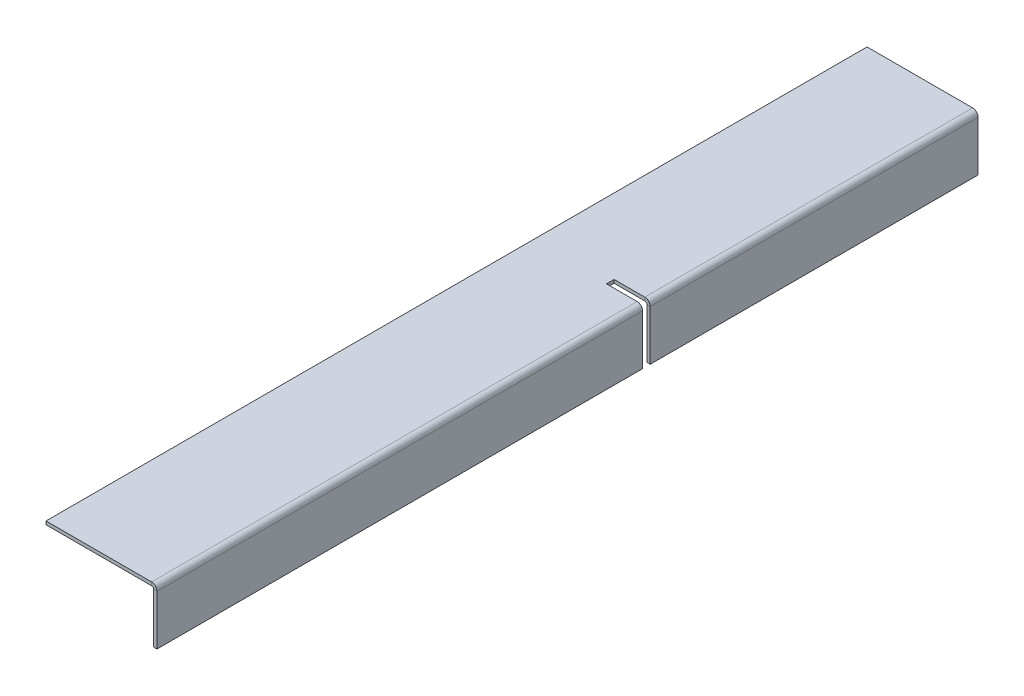
ISO-10303-21;
HEADER;
FILE_DESCRIPTION(('STEP AP214'),'2;1');
FILE_NAME('part.step','',(''),(''),'','','');
FILE_SCHEMA(('AUTOMOTIVE_DESIGN { 1 0 10303 214 1 1 1 1 }'));
ENDSEC;
DATA;
#1=APPLICATION_CONTEXT('core data for automotive mechanical design processes');
#2=APPLICATION_PROTOCOL_DEFINITION('international standard','automotive_design',2000,#1);
#3=PRODUCT_CONTEXT('',#1,'mechanical');
#4=PRODUCT('Part','Part','',(#3));
#5=PRODUCT_RELATED_PRODUCT_CATEGORY('part','',(#4));
#6=PRODUCT_DEFINITION_FORMATION('','',#4);
#7=PRODUCT_DEFINITION_CONTEXT('part definition',#1,'design');
#8=PRODUCT_DEFINITION('design','',#6,#7);
#9=PRODUCT_DEFINITION_SHAPE('','',#8);
#10=(LENGTH_UNIT() NAMED_UNIT(*) SI_UNIT(.MILLI.,.METRE.));
#11=(NAMED_UNIT(*) PLANE_ANGLE_UNIT() SI_UNIT($,.RADIAN.));
#12=(NAMED_UNIT(*) SI_UNIT($,.STERADIAN.) SOLID_ANGLE_UNIT());
#13=UNCERTAINTY_MEASURE_WITH_UNIT(LENGTH_MEASURE(1.E-05),#10,'distance_accuracy_value','');
#14=(GEOMETRIC_REPRESENTATION_CONTEXT(3) GLOBAL_UNCERTAINTY_ASSIGNED_CONTEXT((#13)) GLOBAL_UNIT_ASSIGNED_CONTEXT((#10,
#11,#12)) REPRESENTATION_CONTEXT('',''));
#15=CARTESIAN_POINT('',(0.,0.,0.));
#16=DIRECTION('',(0.,0.,1.));
#17=DIRECTION('',(1.,0.,0.));
#18=AXIS2_PLACEMENT_3D('',#15,#16,#17);
#19=CARTESIAN_POINT('',(-13.,20.2395491076024,118.183385949314));
#20=DIRECTION('',(0.,0.,-1.));
#21=DIRECTION('',(-1.,0.,0.));
#22=AXIS2_PLACEMENT_3D('',#19,#20,#21);
#23=PLANE('',#22);
#24=DIRECTION('',(0.,1.,0.));
#25=VECTOR('',#24,1.);
#26=CARTESIAN_POINT('',(0.,20.2395491076024,118.183385949314));
#27=LINE('',#26,#25);
#28=CARTESIAN_POINT('',(0.,0.,118.183385949314));
#29=VERTEX_POINT('',#28);
#30=CARTESIAN_POINT('',(0.,18.0634,118.183385949314));
#31=VERTEX_POINT('',#30);
#32=EDGE_CURVE('E305',#29,#31,#27,.T.);
#33=ORIENTED_EDGE('',*,*,#32,.T.);
#34=DIRECTION('',(-1.,0.,0.));
#35=VECTOR('',#34,1.);
#36=CARTESIAN_POINT('',(0.,18.0634,118.183385949314));
#37=LINE('',#36,#35);
#38=CARTESIAN_POINT('',(-1.19999999999998,18.0634,118.183385949314));
#39=VERTEX_POINT('',#38);
#40=EDGE_CURVE('E11',#31,#39,#37,.T.);
#41=ORIENTED_EDGE('',*,*,#40,.T.);
#42=DIRECTION('',(0.,-1.,0.));
#43=VECTOR('',#42,1.);
#44=CARTESIAN_POINT('',(-1.19999999999998,0.,118.183385949314));
#45=LINE('',#44,#43);
#46=CARTESIAN_POINT('',(-1.19999999999998,0.,118.183385949314));
#47=VERTEX_POINT('',#46);
#48=EDGE_CURVE('E312',#39,#47,#45,.T.);
#49=ORIENTED_EDGE('',*,*,#48,.T.);
#50=DIRECTION('',(1.,0.,0.));
#51=VECTOR('',#50,1.);
#52=CARTESIAN_POINT('',(0.,0.,118.183385949314));
#53=LINE('',#52,#51);
#54=EDGE_CURVE('E285',#47,#29,#53,.T.);
#55=ORIENTED_EDGE('',*,*,#54,.T.);
#56=EDGE_LOOP('',(#33,#41,#49,#55));
#57=FACE_BOUND('',#56,.T.);
#58=ADVANCED_FACE('F44',(#57),#23,.F.);
#59=DIRECTION('',(1.,0.,0.));
#60=VECTOR('',#59,1.);
#61=CARTESIAN_POINT('',(0.,18.8,118.183385949314));
#62=LINE('',#61,#60);
#63=CARTESIAN_POINT('',(-13.,18.8,118.183385949314));
#64=VERTEX_POINT('',#63);
#65=CARTESIAN_POINT('',(-1.93659999999996,18.8,118.183385949314));
#66=VERTEX_POINT('',#65);
#67=EDGE_CURVE('E274',#64,#66,#62,.T.);
#68=ORIENTED_EDGE('',*,*,#67,.T.);
#69=DIRECTION('',(0.,1.,0.));
#70=VECTOR('',#69,1.);
#71=CARTESIAN_POINT('',(-1.93659999999996,18.8,118.183385949314));
#72=LINE('',#71,#70);
#73=CARTESIAN_POINT('',(-1.93659999999996,20.,118.183385949314));
#74=VERTEX_POINT('',#73);
#75=EDGE_CURVE('E53',#66,#74,#72,.T.);
#76=ORIENTED_EDGE('',*,*,#75,.T.);
#77=DIRECTION('',(1.,0.,0.));
#78=VECTOR('',#77,1.);
#79=CARTESIAN_POINT('',(0.,20.,118.183385949314));
#80=LINE('',#79,#78);
#81=CARTESIAN_POINT('',(-13.,20.,118.183385949314));
#82=VERTEX_POINT('',#81);
#83=EDGE_CURVE('E270',#82,#74,#80,.T.);
#84=ORIENTED_EDGE('',*,*,#83,.F.);
#85=DIRECTION('',(0.,1.,0.));
#86=VECTOR('',#85,1.);
#87=CARTESIAN_POINT('',(-13.,20.2395491076024,118.183385949314));
#88=LINE('',#87,#86);
#89=EDGE_CURVE('E286',#64,#82,#88,.T.);
#90=ORIENTED_EDGE('',*,*,#89,.F.);
#91=EDGE_LOOP('',(#68,#76,#84,#90));
#92=FACE_BOUND('',#91,.T.);
#93=ADVANCED_FACE('F267',(#92),#23,.F.);
#94=CARTESIAN_POINT('',(-13.,20.2395491076025,120.933385949314));
#95=DIRECTION('',(0.,0.,1.));
#96=DIRECTION('',(1.,0.,0.));
#97=AXIS2_PLACEMENT_3D('',#94,#95,#96);
#98=PLANE('',#97);
#99=DIRECTION('',(0.,1.,0.));
#100=VECTOR('',#99,1.);
#101=CARTESIAN_POINT('',(-1.19999999999998,0.,120.933385949314));
#102=LINE('',#101,#100);
#103=CARTESIAN_POINT('',(-1.19999999999998,0.,120.933385949314));
#104=VERTEX_POINT('',#103);
#105=CARTESIAN_POINT('',(-1.19999999999998,18.0634,120.933385949314));
#106=VERTEX_POINT('',#105);
#107=EDGE_CURVE('E331',#104,#106,#102,.T.);
#108=ORIENTED_EDGE('',*,*,#107,.T.);
#109=DIRECTION('',(1.,0.,0.));
#110=VECTOR('',#109,1.);
#111=CARTESIAN_POINT('',(-1.19999999999998,18.0634,120.933385949314));
#112=LINE('',#111,#110);
#113=CARTESIAN_POINT('',(0.,18.0634,120.933385949314));
#114=VERTEX_POINT('',#113);
#115=EDGE_CURVE('E254',#106,#114,#112,.T.);
#116=ORIENTED_EDGE('',*,*,#115,.T.);
#117=DIRECTION('',(0.,-1.,0.));
#118=VECTOR('',#117,1.);
#119=CARTESIAN_POINT('',(0.,20.2395491076025,120.933385949314));
#120=LINE('',#119,#118);
#121=CARTESIAN_POINT('',(0.,0.,120.933385949314));
#122=VERTEX_POINT('',#121);
#123=EDGE_CURVE('E308',#114,#122,#120,.T.);
#124=ORIENTED_EDGE('',*,*,#123,.T.);
#125=DIRECTION('',(-1.,0.,0.));
#126=VECTOR('',#125,1.);
#127=CARTESIAN_POINT('',(0.,0.,120.933385949314));
#128=LINE('',#127,#126);
#129=EDGE_CURVE('E135',#122,#104,#128,.T.);
#130=ORIENTED_EDGE('',*,*,#129,.T.);
#131=EDGE_LOOP('',(#108,#116,#124,#130));
#132=FACE_BOUND('',#131,.T.);
#133=ADVANCED_FACE('F394',(#132),#98,.F.);
#134=DIRECTION('',(-1.,0.,0.));
#135=VECTOR('',#134,1.);
#136=CARTESIAN_POINT('',(0.,20.,120.933385949314));
#137=LINE('',#136,#135);
#138=CARTESIAN_POINT('',(-1.93659999999996,20.,120.933385949314));
#139=VERTEX_POINT('',#138);
#140=CARTESIAN_POINT('',(-13.,20.,120.933385949314));
#141=VERTEX_POINT('',#140);
#142=EDGE_CURVE('E322',#139,#141,#137,.T.);
#143=ORIENTED_EDGE('',*,*,#142,.F.);
#144=DIRECTION('',(0.,-1.,0.));
#145=VECTOR('',#144,1.);
#146=CARTESIAN_POINT('',(-1.93659999999996,20.,120.933385949314));
#147=LINE('',#146,#145);
#148=CARTESIAN_POINT('',(-1.93659999999996,18.8,120.933385949314));
#149=VERTEX_POINT('',#148);
#150=EDGE_CURVE('E250',#139,#149,#147,.T.);
#151=ORIENTED_EDGE('',*,*,#150,.T.);
#152=DIRECTION('',(-1.,0.,0.));
#153=VECTOR('',#152,1.);
#154=CARTESIAN_POINT('',(0.,18.8,120.933385949314));
#155=LINE('',#154,#153);
#156=CARTESIAN_POINT('',(-13.,18.8,120.933385949314));
#157=VERTEX_POINT('',#156);
#158=EDGE_CURVE('E339',#149,#157,#155,.T.);
#159=ORIENTED_EDGE('',*,*,#158,.T.);
#160=DIRECTION('',(0.,-1.,0.));
#161=VECTOR('',#160,1.);
#162=CARTESIAN_POINT('',(-13.,20.2395491076025,120.933385949314));
#163=LINE('',#162,#161);
#164=EDGE_CURVE('E307',#141,#157,#163,.T.);
#165=ORIENTED_EDGE('',*,*,#164,.F.);
#166=EDGE_LOOP('',(#143,#151,#159,#165));
#167=FACE_BOUND('',#166,.T.);
#168=ADVANCED_FACE('F414',(#167),#98,.F.);
#169=CARTESIAN_POINT('',(-1.93659999999996,18.0634,296.));
#170=DIRECTION('',(0.,0.,-1.));
#171=DIRECTION('',(-1.,0.,0.));
#172=AXIS2_PLACEMENT_3D('',#169,#170,#171);
#173=CYLINDRICAL_SURFACE('',#172,0.7366);
#174=CARTESIAN_POINT('',(-1.93659999999996,18.0634,120.933385949314));
#175=DIRECTION('',(0.,0.,1.));
#176=DIRECTION('',(1.,0.,0.));
#177=AXIS2_PLACEMENT_3D('',#174,#175,#176);
#178=CIRCLE('',#177,0.7366);
#179=EDGE_CURVE('E335',#106,#149,#178,.T.);
#180=ORIENTED_EDGE('',*,*,#179,.F.);
#181=DIRECTION('',(0.,0.,-1.));
#182=VECTOR('',#181,1.);
#183=CARTESIAN_POINT('',(-1.19999999999998,18.0634,296.));
#184=LINE('',#183,#182);
#185=CARTESIAN_POINT('',(-1.19999999999998,18.0634,296.));
#186=VERTEX_POINT('',#185);
#187=EDGE_CURVE('E211',#186,#106,#184,.T.);
#188=ORIENTED_EDGE('',*,*,#187,.F.);
#189=CARTESIAN_POINT('',(-1.93659999999996,18.0634,296.));
#190=DIRECTION('',(0.,0.,1.));
#191=DIRECTION('',(1.,0.,0.));
#192=AXIS2_PLACEMENT_3D('',#189,#190,#191);
#193=CIRCLE('',#192,0.7366);
#194=CARTESIAN_POINT('',(-1.93659999999996,18.8,296.));
#195=VERTEX_POINT('',#194);
#196=EDGE_CURVE('E162',#186,#195,#193,.T.);
#197=ORIENTED_EDGE('',*,*,#196,.T.);
#198=DIRECTION('',(0.,0.,-1.));
#199=VECTOR('',#198,1.);
#200=CARTESIAN_POINT('',(-1.93659999999996,18.8,296.));
#201=LINE('',#200,#199);
#202=EDGE_CURVE('E216',#195,#149,#201,.T.);
#203=ORIENTED_EDGE('',*,*,#202,.T.);
#204=EDGE_LOOP('',(#180,#188,#197,#203));
#205=FACE_BOUND('',#204,.T.);
#206=ADVANCED_FACE('F361',(#205),#173,.F.);
#207=CARTESIAN_POINT('',(-1.19999999999998,0.,296.));
#208=DIRECTION('',(-1.,0.,0.));
#209=DIRECTION('',(0.,0.,1.));
#210=AXIS2_PLACEMENT_3D('',#207,#208,#209);
#211=PLANE('',#210);
#212=ORIENTED_EDGE('',*,*,#107,.F.);
#213=DIRECTION('',(0.,0.,-1.));
#214=VECTOR('',#213,1.);
#215=CARTESIAN_POINT('',(-1.19999999999998,0.,296.));
#216=LINE('',#215,#214);
#217=CARTESIAN_POINT('',(-1.19999999999998,0.,296.));
#218=VERTEX_POINT('',#217);
#219=EDGE_CURVE('E207',#218,#104,#216,.T.);
#220=ORIENTED_EDGE('',*,*,#219,.F.);
#221=DIRECTION('',(0.,1.,0.));
#222=VECTOR('',#221,1.);
#223=CARTESIAN_POINT('',(-1.19999999999998,0.,296.));
#224=LINE('',#223,#222);
#225=EDGE_CURVE('E156',#218,#186,#224,.T.);
#226=ORIENTED_EDGE('',*,*,#225,.T.);
#227=ORIENTED_EDGE('',*,*,#187,.T.);
#228=EDGE_LOOP('',(#212,#220,#226,#227));
#229=FACE_BOUND('',#228,.T.);
#230=ADVANCED_FACE('F366',(#229),#211,.T.);
#231=CARTESIAN_POINT('',(0.,0.,296.));
#232=DIRECTION('',(0.,-1.,0.));
#233=DIRECTION('',(0.,0.,-1.));
#234=AXIS2_PLACEMENT_3D('',#231,#232,#233);
#235=PLANE('',#234);
#236=ORIENTED_EDGE('',*,*,#129,.F.);
#237=DIRECTION('',(0.,0.,-1.));
#238=VECTOR('',#237,1.);
#239=CARTESIAN_POINT('',(0.,0.,296.));
#240=LINE('',#239,#238);
#241=CARTESIAN_POINT('',(0.,0.,296.));
#242=VERTEX_POINT('',#241);
#243=EDGE_CURVE('E127',#242,#122,#240,.T.);
#244=ORIENTED_EDGE('',*,*,#243,.F.);
#245=DIRECTION('',(-1.,0.,0.));
#246=VECTOR('',#245,1.);
#247=CARTESIAN_POINT('',(0.,0.,296.));
#248=LINE('',#247,#246);
#249=EDGE_CURVE('E132',#242,#218,#248,.T.);
#250=ORIENTED_EDGE('',*,*,#249,.T.);
#251=ORIENTED_EDGE('',*,*,#219,.T.);
#252=EDGE_LOOP('',(#236,#244,#250,#251));
#253=FACE_BOUND('',#252,.T.);
#254=ADVANCED_FACE('F129',(#253),#235,.T.);
#255=CARTESIAN_POINT('',(0.,0.,296.));
#256=DIRECTION('',(-1.,0.,0.));
#257=DIRECTION('',(0.,0.,1.));
#258=AXIS2_PLACEMENT_3D('',#255,#256,#257);
#259=PLANE('',#258);
#260=ORIENTED_EDGE('',*,*,#243,.T.);
#261=ORIENTED_EDGE('',*,*,#123,.F.);
#262=DIRECTION('',(0.,0.,-1.));
#263=VECTOR('',#262,1.);
#264=CARTESIAN_POINT('',(0.,18.0634,296.));
#265=LINE('',#264,#263);
#266=CARTESIAN_POINT('',(0.,18.0634,296.));
#267=VERTEX_POINT('',#266);
#268=EDGE_CURVE('E147',#267,#114,#265,.T.);
#269=ORIENTED_EDGE('',*,*,#268,.F.);
#270=DIRECTION('',(0.,1.,0.));
#271=VECTOR('',#270,1.);
#272=CARTESIAN_POINT('',(0.,0.,296.));
#273=LINE('',#272,#271);
#274=EDGE_CURVE('E144',#242,#267,#273,.T.);
#275=ORIENTED_EDGE('',*,*,#274,.F.);
#276=EDGE_LOOP('',(#260,#261,#269,#275));
#277=FACE_BOUND('',#276,.T.);
#278=ADVANCED_FACE('F145',(#277),#259,.F.);
#279=CARTESIAN_POINT('',(-1.93659999999996,18.0634,296.));
#280=DIRECTION('',(0.,0.,-1.));
#281=DIRECTION('',(-1.,0.,0.));
#282=AXIS2_PLACEMENT_3D('',#279,#280,#281);
#283=CYLINDRICAL_SURFACE('',#282,1.9366);
#284=ORIENTED_EDGE('',*,*,#268,.T.);
#285=CARTESIAN_POINT('',(-1.93659999999996,18.0634,120.933385949314));
#286=DIRECTION('',(0.,0.,1.));
#287=DIRECTION('',(1.,0.,0.));
#288=AXIS2_PLACEMENT_3D('',#285,#286,#287);
#289=CIRCLE('',#288,1.9366);
#290=EDGE_CURVE('E242',#114,#139,#289,.T.);
#291=ORIENTED_EDGE('',*,*,#290,.T.);
#292=DIRECTION('',(0.,0.,-1.));
#293=VECTOR('',#292,1.);
#294=CARTESIAN_POINT('',(-1.93659999999996,20.,296.));
#295=LINE('',#294,#293);
#296=CARTESIAN_POINT('',(-1.93659999999996,20.,296.));
#297=VERTEX_POINT('',#296);
#298=EDGE_CURVE('E200',#297,#139,#295,.T.);
#299=ORIENTED_EDGE('',*,*,#298,.F.);
#300=CARTESIAN_POINT('',(-1.93659999999996,18.0634,296.));
#301=DIRECTION('',(0.,0.,-1.));
#302=DIRECTION('',(-1.,0.,0.));
#303=AXIS2_PLACEMENT_3D('',#300,#301,#302);
#304=CIRCLE('',#303,1.9366);
#305=EDGE_CURVE('E151',#267,#297,#304,.F.);
#306=ORIENTED_EDGE('',*,*,#305,.F.);
#307=EDGE_LOOP('',(#284,#291,#299,#306));
#308=FACE_BOUND('',#307,.T.);
#309=ADVANCED_FACE('F402',(#308),#283,.T.);
#310=CARTESIAN_POINT('',(0.,18.0634,296.));
#311=DIRECTION('',(0.,0.,1.));
#312=DIRECTION('',(1.,0.,0.));
#313=AXIS2_PLACEMENT_3D('',#310,#311,#312);
#314=PLANE('',#313);
#315=DIRECTION('',(-1.,0.,0.));
#316=VECTOR('',#315,1.);
#317=CARTESIAN_POINT('',(0.,18.0634,296.));
#318=LINE('',#317,#316);
#319=EDGE_CURVE('E235',#267,#186,#318,.T.);
#320=ORIENTED_EDGE('',*,*,#319,.F.);
#321=ORIENTED_EDGE('',*,*,#305,.T.);
#322=DIRECTION('',(0.,1.,0.));
#323=VECTOR('',#322,1.);
#324=CARTESIAN_POINT('',(-1.93659999999996,18.8,296.));
#325=LINE('',#324,#323);
#326=EDGE_CURVE('E67',#195,#297,#325,.T.);
#327=ORIENTED_EDGE('',*,*,#326,.F.);
#328=ORIENTED_EDGE('',*,*,#196,.F.);
#329=EDGE_LOOP('',(#320,#321,#327,#328));
#330=FACE_BOUND('',#329,.T.);
#331=ADVANCED_FACE('F46',(#330),#314,.T.);
#332=CARTESIAN_POINT('',(-1.93659999999996,18.8,296.));
#333=DIRECTION('',(0.,0.,1.));
#334=DIRECTION('',(1.,0.,0.));
#335=AXIS2_PLACEMENT_3D('',#332,#333,#334);
#336=PLANE('',#335);
#337=ORIENTED_EDGE('',*,*,#274,.T.);
#338=ORIENTED_EDGE('',*,*,#319,.T.);
#339=ORIENTED_EDGE('',*,*,#225,.F.);
#340=ORIENTED_EDGE('',*,*,#249,.F.);
#341=EDGE_LOOP('',(#337,#338,#339,#340));
#342=FACE_BOUND('',#341,.T.);
#343=ADVANCED_FACE('F154',(#342),#336,.T.);
#344=CARTESIAN_POINT('',(-1.93659999999996,20.0000000000001,0.));
#345=DIRECTION('',(0.,0.,-1.));
#346=DIRECTION('',(-1.,0.,0.));
#347=AXIS2_PLACEMENT_3D('',#344,#345,#346);
#348=PLANE('',#347);
#349=DIRECTION('',(0.,-1.,0.));
#350=VECTOR('',#349,1.);
#351=CARTESIAN_POINT('',(-1.93659999999996,20.0000000000001,0.));
#352=LINE('',#351,#350);
#353=CARTESIAN_POINT('',(-1.93659999999996,20.0000000000001,0.));
#354=VERTEX_POINT('',#353);
#355=CARTESIAN_POINT('',(-1.93659999999996,18.8000000000001,0.));
#356=VERTEX_POINT('',#355);
#357=EDGE_CURVE('E230',#354,#356,#352,.T.);
#358=ORIENTED_EDGE('',*,*,#357,.F.);
#359=CARTESIAN_POINT('',(-1.93659999999996,18.0634,0.));
#360=DIRECTION('',(0.,0.,-1.));
#361=DIRECTION('',(-1.,0.,0.));
#362=AXIS2_PLACEMENT_3D('',#359,#360,#361);
#363=CIRCLE('',#362,1.9366);
#364=CARTESIAN_POINT('',(0.,18.0634,0.));
#365=VERTEX_POINT('',#364);
#366=EDGE_CURVE('E196',#365,#354,#363,.F.);
#367=ORIENTED_EDGE('',*,*,#366,.F.);
#368=DIRECTION('',(1.,0.,0.));
#369=VECTOR('',#368,1.);
#370=CARTESIAN_POINT('',(-1.19999999999998,18.0634,0.));
#371=LINE('',#370,#369);
#372=CARTESIAN_POINT('',(-1.19999999999998,18.0634,0.));
#373=VERTEX_POINT('',#372);
#374=EDGE_CURVE('E226',#373,#365,#371,.T.);
#375=ORIENTED_EDGE('',*,*,#374,.F.);
#376=CARTESIAN_POINT('',(-1.93659999999996,18.0634,0.));
#377=DIRECTION('',(0.,0.,1.));
#378=DIRECTION('',(1.,0.,0.));
#379=AXIS2_PLACEMENT_3D('',#376,#377,#378);
#380=CIRCLE('',#379,0.7366);
#381=EDGE_CURVE('E180',#373,#356,#380,.T.);
#382=ORIENTED_EDGE('',*,*,#381,.T.);
#383=EDGE_LOOP('',(#358,#367,#375,#382));
#384=FACE_BOUND('',#383,.T.);
#385=ADVANCED_FACE('F431',(#384),#348,.T.);
#386=CARTESIAN_POINT('',(-1.19999999999998,18.0634,0.));
#387=DIRECTION('',(0.,0.,-1.));
#388=DIRECTION('',(-1.,0.,0.));
#389=AXIS2_PLACEMENT_3D('',#386,#387,#388);
#390=PLANE('',#389);
#391=DIRECTION('',(-1.,0.,0.));
#392=VECTOR('',#391,1.);
#393=CARTESIAN_POINT('',(0.,20.0000000000001,0.));
#394=LINE('',#393,#392);
#395=CARTESIAN_POINT('',(-40.,20.0000000000001,0.));
#396=VERTEX_POINT('',#395);
#397=EDGE_CURVE('E168',#354,#396,#394,.T.);
#398=ORIENTED_EDGE('',*,*,#397,.F.);
#399=ORIENTED_EDGE('',*,*,#357,.T.);
#400=DIRECTION('',(1.,0.,0.));
#401=VECTOR('',#400,1.);
#402=CARTESIAN_POINT('',(0.,18.8000000000001,0.));
#403=LINE('',#402,#401);
#404=CARTESIAN_POINT('',(-40.,18.8000000000001,0.));
#405=VERTEX_POINT('',#404);
#406=EDGE_CURVE('E176',#356,#405,#403,.F.);
#407=ORIENTED_EDGE('',*,*,#406,.T.);
#408=DIRECTION('',(0.,1.,0.));
#409=VECTOR('',#408,1.);
#410=CARTESIAN_POINT('',(-40.,18.8000000000001,0.));
#411=LINE('',#410,#409);
#412=EDGE_CURVE('E171',#405,#396,#411,.T.);
#413=ORIENTED_EDGE('',*,*,#412,.T.);
#414=EDGE_LOOP('',(#398,#399,#407,#413));
#415=FACE_BOUND('',#414,.T.);
#416=ADVANCED_FACE('F429',(#415),#390,.T.);
#417=CARTESIAN_POINT('',(0.,20.,296.));
#418=DIRECTION('',(0.,-1.,0.));
#419=DIRECTION('',(0.,0.,-1.));
#420=AXIS2_PLACEMENT_3D('',#417,#418,#419);
#421=PLANE('',#420);
#422=ORIENTED_EDGE('',*,*,#298,.T.);
#423=ORIENTED_EDGE('',*,*,#142,.T.);
#424=DIRECTION('',(0.,0.,1.));
#425=VECTOR('',#424,1.);
#426=CARTESIAN_POINT('',(-13.,20.,296.));
#427=LINE('',#426,#425);
#428=EDGE_CURVE('E172',#82,#141,#427,.T.);
#429=ORIENTED_EDGE('',*,*,#428,.F.);
#430=ORIENTED_EDGE('',*,*,#83,.T.);
#431=EDGE_CURVE('E102',#74,#354,#295,.T.);
#432=ORIENTED_EDGE('',*,*,#431,.T.);
#433=ORIENTED_EDGE('',*,*,#397,.T.);
#434=DIRECTION('',(0.,0.,-1.));
#435=VECTOR('',#434,1.);
#436=CARTESIAN_POINT('',(-40.,20.,296.));
#437=LINE('',#436,#435);
#438=CARTESIAN_POINT('',(-40.,20.,296.));
#439=VERTEX_POINT('',#438);
#440=EDGE_CURVE('E223',#439,#396,#437,.T.);
#441=ORIENTED_EDGE('',*,*,#440,.F.);
#442=DIRECTION('',(-1.,0.,0.));
#443=VECTOR('',#442,1.);
#444=CARTESIAN_POINT('',(0.,20.,296.));
#445=LINE('',#444,#443);
#446=EDGE_CURVE('E108',#297,#439,#445,.T.);
#447=ORIENTED_EDGE('',*,*,#446,.F.);
#448=EDGE_LOOP('',(#422,#423,#429,#430,#432,#433,#441,#447));
#449=FACE_BOUND('',#448,.T.);
#450=ADVANCED_FACE('F282',(#449),#421,.F.);
#451=CARTESIAN_POINT('',(-40.,18.8,296.));
#452=DIRECTION('',(-1.,0.,0.));
#453=DIRECTION('',(0.,0.,1.));
#454=AXIS2_PLACEMENT_3D('',#451,#452,#453);
#455=PLANE('',#454);
#456=ORIENTED_EDGE('',*,*,#412,.F.);
#457=DIRECTION('',(0.,0.,-1.));
#458=VECTOR('',#457,1.);
#459=CARTESIAN_POINT('',(-40.,18.8,296.));
#460=LINE('',#459,#458);
#461=CARTESIAN_POINT('',(-40.,18.8,296.));
#462=VERTEX_POINT('',#461);
#463=EDGE_CURVE('E220',#462,#405,#460,.T.);
#464=ORIENTED_EDGE('',*,*,#463,.F.);
#465=DIRECTION('',(0.,1.,0.));
#466=VECTOR('',#465,1.);
#467=CARTESIAN_POINT('',(-40.,18.8,296.));
#468=LINE('',#467,#466);
#469=EDGE_CURVE('E347',#462,#439,#468,.T.);
#470=ORIENTED_EDGE('',*,*,#469,.T.);
#471=ORIENTED_EDGE('',*,*,#440,.T.);
#472=EDGE_LOOP('',(#456,#464,#470,#471));
#473=FACE_BOUND('',#472,.T.);
#474=ADVANCED_FACE('F405',(#473),#455,.T.);
#475=CARTESIAN_POINT('',(0.,18.8,296.));
#476=DIRECTION('',(0.,-1.,0.));
#477=DIRECTION('',(0.,0.,-1.));
#478=AXIS2_PLACEMENT_3D('',#475,#476,#477);
#479=PLANE('',#478);
#480=ORIENTED_EDGE('',*,*,#158,.F.);
#481=ORIENTED_EDGE('',*,*,#202,.F.);
#482=DIRECTION('',(1.,0.,0.));
#483=VECTOR('',#482,1.);
#484=CARTESIAN_POINT('',(0.,18.8,296.));
#485=LINE('',#484,#483);
#486=EDGE_CURVE('E351',#195,#462,#485,.F.);
#487=ORIENTED_EDGE('',*,*,#486,.T.);
#488=ORIENTED_EDGE('',*,*,#463,.T.);
#489=ORIENTED_EDGE('',*,*,#406,.F.);
#490=EDGE_CURVE('E215',#66,#356,#201,.T.);
#491=ORIENTED_EDGE('',*,*,#490,.F.);
#492=ORIENTED_EDGE('',*,*,#67,.F.);
#493=DIRECTION('',(0.,0.,1.));
#494=VECTOR('',#493,1.);
#495=CARTESIAN_POINT('',(-13.,18.8,296.));
#496=LINE('',#495,#494);
#497=EDGE_CURVE('E246',#64,#157,#496,.T.);
#498=ORIENTED_EDGE('',*,*,#497,.T.);
#499=EDGE_LOOP('',(#480,#481,#487,#488,#489,#491,#492,#498));
#500=FACE_BOUND('',#499,.T.);
#501=ADVANCED_FACE('F409',(#500),#479,.T.);
#502=CARTESIAN_POINT('',(-1.93659999999996,18.0634,118.183385949314));
#503=DIRECTION('',(0.,0.,-1.));
#504=DIRECTION('',(-1.,0.,0.));
#505=AXIS2_PLACEMENT_3D('',#502,#503,#504);
#506=CIRCLE('',#505,0.7366);
#507=EDGE_CURVE('E316',#66,#39,#506,.T.);
#508=ORIENTED_EDGE('',*,*,#507,.F.);
#509=ORIENTED_EDGE('',*,*,#490,.T.);
#510=ORIENTED_EDGE('',*,*,#381,.F.);
#511=EDGE_CURVE('E210',#39,#373,#184,.T.);
#512=ORIENTED_EDGE('',*,*,#511,.F.);
#513=EDGE_LOOP('',(#508,#509,#510,#512));
#514=FACE_BOUND('',#513,.T.);
#515=ADVANCED_FACE('F426',(#514),#173,.F.);
#516=ORIENTED_EDGE('',*,*,#48,.F.);
#517=ORIENTED_EDGE('',*,*,#511,.T.);
#518=DIRECTION('',(0.,1.,0.));
#519=VECTOR('',#518,1.);
#520=CARTESIAN_POINT('',(-1.19999999999998,0.,0.));
#521=LINE('',#520,#519);
#522=CARTESIAN_POINT('',(-1.19999999999998,0.,0.));
#523=VERTEX_POINT('',#522);
#524=EDGE_CURVE('E184',#523,#373,#521,.T.);
#525=ORIENTED_EDGE('',*,*,#524,.F.);
#526=EDGE_CURVE('E139',#47,#523,#216,.T.);
#527=ORIENTED_EDGE('',*,*,#526,.F.);
#528=EDGE_LOOP('',(#516,#517,#525,#527));
#529=FACE_BOUND('',#528,.T.);
#530=ADVANCED_FACE('F448',(#529),#211,.T.);
#531=ORIENTED_EDGE('',*,*,#54,.F.);
#532=ORIENTED_EDGE('',*,*,#526,.T.);
#533=DIRECTION('',(-1.,0.,0.));
#534=VECTOR('',#533,1.);
#535=CARTESIAN_POINT('',(0.,0.,0.));
#536=LINE('',#535,#534);
#537=CARTESIAN_POINT('',(0.,0.,0.));
#538=VERTEX_POINT('',#537);
#539=EDGE_CURVE('E188',#538,#523,#536,.T.);
#540=ORIENTED_EDGE('',*,*,#539,.F.);
#541=EDGE_CURVE('E140',#29,#538,#240,.T.);
#542=ORIENTED_EDGE('',*,*,#541,.F.);
#543=EDGE_LOOP('',(#531,#532,#540,#542));
#544=FACE_BOUND('',#543,.T.);
#545=ADVANCED_FACE('F444',(#544),#235,.T.);
#546=EDGE_CURVE('E204',#31,#365,#265,.T.);
#547=ORIENTED_EDGE('',*,*,#546,.F.);
#548=ORIENTED_EDGE('',*,*,#32,.F.);
#549=ORIENTED_EDGE('',*,*,#541,.T.);
#550=DIRECTION('',(0.,1.,0.));
#551=VECTOR('',#550,1.);
#552=CARTESIAN_POINT('',(0.,0.,0.));
#553=LINE('',#552,#551);
#554=EDGE_CURVE('E192',#538,#365,#553,.T.);
#555=ORIENTED_EDGE('',*,*,#554,.T.);
#556=EDGE_LOOP('',(#547,#548,#549,#555));
#557=FACE_BOUND('',#556,.T.);
#558=ADVANCED_FACE('F439',(#557),#259,.F.);
#559=ORIENTED_EDGE('',*,*,#431,.F.);
#560=CARTESIAN_POINT('',(-1.93659999999996,18.0634,118.183385949314));
#561=DIRECTION('',(0.,0.,-1.));
#562=DIRECTION('',(-1.,0.,0.));
#563=AXIS2_PLACEMENT_3D('',#560,#561,#562);
#564=CIRCLE('',#563,1.9366);
#565=EDGE_CURVE('E238',#74,#31,#564,.T.);
#566=ORIENTED_EDGE('',*,*,#565,.T.);
#567=ORIENTED_EDGE('',*,*,#546,.T.);
#568=ORIENTED_EDGE('',*,*,#366,.T.);
#569=EDGE_LOOP('',(#559,#566,#567,#568));
#570=FACE_BOUND('',#569,.T.);
#571=ADVANCED_FACE('F288',(#570),#283,.T.);
#572=CARTESIAN_POINT('',(-1.93659999999996,18.0634,296.));
#573=DIRECTION('',(0.,0.,1.));
#574=DIRECTION('',(1.,0.,0.));
#575=AXIS2_PLACEMENT_3D('',#572,#573,#574);
#576=PLANE('',#575);
#577=ORIENTED_EDGE('',*,*,#446,.T.);
#578=ORIENTED_EDGE('',*,*,#469,.F.);
#579=ORIENTED_EDGE('',*,*,#486,.F.);
#580=ORIENTED_EDGE('',*,*,#326,.T.);
#581=EDGE_LOOP('',(#577,#578,#579,#580));
#582=FACE_BOUND('',#581,.T.);
#583=ADVANCED_FACE('F406',(#582),#576,.T.);
#584=CARTESIAN_POINT('',(-1.93659999999996,18.0634,0.));
#585=DIRECTION('',(0.,0.,1.));
#586=DIRECTION('',(1.,0.,0.));
#587=AXIS2_PLACEMENT_3D('',#584,#585,#586);
#588=PLANE('',#587);
#589=ORIENTED_EDGE('',*,*,#524,.T.);
#590=ORIENTED_EDGE('',*,*,#374,.T.);
#591=ORIENTED_EDGE('',*,*,#554,.F.);
#592=ORIENTED_EDGE('',*,*,#539,.T.);
#593=EDGE_LOOP('',(#589,#590,#591,#592));
#594=FACE_BOUND('',#593,.T.);
#595=ADVANCED_FACE('F435',(#594),#588,.F.);
#596=CARTESIAN_POINT('',(-13.,0.,0.));
#597=DIRECTION('',(1.,0.,0.));
#598=DIRECTION('',(0.,0.,-1.));
#599=AXIS2_PLACEMENT_3D('',#596,#597,#598);
#600=PLANE('',#599);
#601=ORIENTED_EDGE('',*,*,#428,.T.);
#602=ORIENTED_EDGE('',*,*,#164,.T.);
#603=ORIENTED_EDGE('',*,*,#497,.F.);
#604=ORIENTED_EDGE('',*,*,#89,.T.);
#605=EDGE_LOOP('',(#601,#602,#603,#604));
#606=FACE_BOUND('',#605,.T.);
#607=ADVANCED_FACE('F416',(#606),#600,.T.);
#608=ORIENTED_EDGE('',*,*,#115,.F.);
#609=ORIENTED_EDGE('',*,*,#179,.T.);
#610=ORIENTED_EDGE('',*,*,#150,.F.);
#611=ORIENTED_EDGE('',*,*,#290,.F.);
#612=EDGE_LOOP('',(#608,#609,#610,#611));
#613=FACE_BOUND('',#612,.T.);
#614=ADVANCED_FACE('F396',(#613),#98,.F.);
#615=ORIENTED_EDGE('',*,*,#40,.F.);
#616=ORIENTED_EDGE('',*,*,#565,.F.);
#617=ORIENTED_EDGE('',*,*,#75,.F.);
#618=ORIENTED_EDGE('',*,*,#507,.T.);
#619=EDGE_LOOP('',(#615,#616,#617,#618));
#620=FACE_BOUND('',#619,.T.);
#621=ADVANCED_FACE('F278',(#620),#23,.F.);
#622=CLOSED_SHELL('',(#58,#93,#133,#168,#206,#230,#254,#278,#309,#331,#343,#385,#416,#450,#474,
#501,#515,#530,#545,#558,#571,#583,#595,#607,#614,#621));
#623=MANIFOLD_SOLID_BREP('B2',#622);
#624=ADVANCED_BREP_SHAPE_REPRESENTATION('',(#18,#623),#14);
#625=SHAPE_DEFINITION_REPRESENTATION(#9,#624);
ENDSEC;
END-ISO-10303-21;
